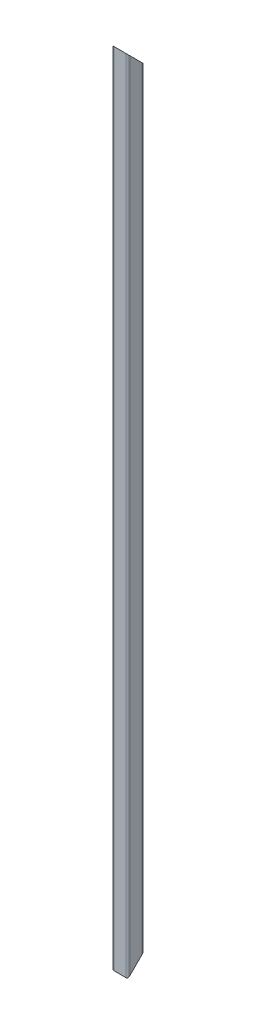
ISO-10303-21;
HEADER;
FILE_DESCRIPTION(('STEP AP214'),'2;1');
FILE_NAME('part.step','',(''),(''),'','','');
FILE_SCHEMA(('AUTOMOTIVE_DESIGN { 1 0 10303 214 1 1 1 1 }'));
ENDSEC;
DATA;
#1=APPLICATION_CONTEXT('core data for automotive mechanical design processes');
#2=APPLICATION_PROTOCOL_DEFINITION('international standard','automotive_design',2000,#1);
#3=PRODUCT_CONTEXT('',#1,'mechanical');
#4=PRODUCT('Part','Part','',(#3));
#5=PRODUCT_RELATED_PRODUCT_CATEGORY('part','',(#4));
#6=PRODUCT_DEFINITION_FORMATION('','',#4);
#7=PRODUCT_DEFINITION_CONTEXT('part definition',#1,'design');
#8=PRODUCT_DEFINITION('design','',#6,#7);
#9=PRODUCT_DEFINITION_SHAPE('','',#8);
#10=(LENGTH_UNIT() NAMED_UNIT(*) SI_UNIT(.MILLI.,.METRE.));
#11=(NAMED_UNIT(*) PLANE_ANGLE_UNIT() SI_UNIT($,.RADIAN.));
#12=(NAMED_UNIT(*) SI_UNIT($,.STERADIAN.) SOLID_ANGLE_UNIT());
#13=UNCERTAINTY_MEASURE_WITH_UNIT(LENGTH_MEASURE(1.E-05),#10,'distance_accuracy_value','');
#14=(GEOMETRIC_REPRESENTATION_CONTEXT(3) GLOBAL_UNCERTAINTY_ASSIGNED_CONTEXT((#13)) GLOBAL_UNIT_ASSIGNED_CONTEXT((#10,
#11,#12)) REPRESENTATION_CONTEXT('',''));
#15=CARTESIAN_POINT('',(0.,0.,0.));
#16=DIRECTION('',(0.,0.,1.));
#17=DIRECTION('',(1.,0.,0.));
#18=AXIS2_PLACEMENT_3D('',#15,#16,#17);
#19=CARTESIAN_POINT('',(-15.5,-2.22044604925031E-13,15.5000000000002));
#20=DIRECTION('',(0.,1.,0.));
#21=DIRECTION('',(0.,0.,1.));
#22=AXIS2_PLACEMENT_3D('',#19,#20,#21);
#23=CYLINDRICAL_SURFACE('',#22,4.5);
#24=CARTESIAN_POINT('',(-15.5,-15.5000000000002,15.5000000000002));
#25=DIRECTION('',(0.,-0.707106781186548,-0.707106781186548));
#26=DIRECTION('',(0.,0.707106781186548,-0.707106781186548));
#27=AXIS2_PLACEMENT_3D('',#24,#25,#26);
#28=ELLIPSE('',#27,6.36396103067893,4.5);
#29=CARTESIAN_POINT('',(-15.5,-20.0000000000002,20.0000000000002));
#30=VERTEX_POINT('',#29);
#31=CARTESIAN_POINT('',(-20.,-15.5000000000002,15.5000000000002));
#32=VERTEX_POINT('',#31);
#33=EDGE_CURVE('E255',#30,#32,#28,.T.);
#34=ORIENTED_EDGE('',*,*,#33,.F.);
#35=DIRECTION('',(0.,1.,0.));
#36=VECTOR('',#35,1.);
#37=CARTESIAN_POINT('',(-15.5,-2.22044604925031E-13,20.0000000000002));
#38=LINE('',#37,#36);
#39=CARTESIAN_POINT('',(-15.5,1980.,20.0000000000002));
#40=VERTEX_POINT('',#39);
#41=EDGE_CURVE('E53',#30,#40,#38,.T.);
#42=ORIENTED_EDGE('',*,*,#41,.T.);
#43=CARTESIAN_POINT('',(-15.5,1975.5,15.5000000000002));
#44=DIRECTION('',(0.,0.707106781186547,-0.707106781186548));
#45=DIRECTION('',(0.,0.707106781186548,0.707106781186547));
#46=AXIS2_PLACEMENT_3D('',#43,#44,#45);
#47=ELLIPSE('',#46,6.36396103067893,4.5);
#48=CARTESIAN_POINT('',(-20.,1975.5,15.5000000000003));
#49=VERTEX_POINT('',#48);
#50=EDGE_CURVE('E176',#49,#40,#47,.T.);
#51=ORIENTED_EDGE('',*,*,#50,.F.);
#52=DIRECTION('',(0.,1.,0.));
#53=VECTOR('',#52,1.);
#54=CARTESIAN_POINT('',(-20.,-2.22044604925031E-13,15.5000000000002));
#55=LINE('',#54,#53);
#56=EDGE_CURVE('E188',#32,#49,#55,.T.);
#57=ORIENTED_EDGE('',*,*,#56,.F.);
#58=EDGE_LOOP('',(#34,#42,#51,#57));
#59=FACE_BOUND('',#58,.T.);
#60=ADVANCED_FACE('F39',(#59),#23,.T.);
#61=CARTESIAN_POINT('',(-20.,-2.22044604925031E-13,15.5000000000002));
#62=DIRECTION('',(1.,0.,0.));
#63=DIRECTION('',(0.,0.,-1.));
#64=AXIS2_PLACEMENT_3D('',#61,#62,#63);
#65=PLANE('',#64);
#66=DIRECTION('',(0.,0.707106781186548,-0.707106781186548));
#67=VECTOR('',#66,1.);
#68=CARTESIAN_POINT('',(-20.,-7.75000000000022,7.75000000000022));
#69=LINE('',#68,#67);
#70=CARTESIAN_POINT('',(-20.,15.4999999999998,-15.4999999999998));
#71=VERTEX_POINT('',#70);
#72=EDGE_CURVE('E290',#32,#71,#69,.T.);
#73=ORIENTED_EDGE('',*,*,#72,.F.);
#74=ORIENTED_EDGE('',*,*,#56,.T.);
#75=DIRECTION('',(0.,0.707106781186548,0.707106781186547));
#76=VECTOR('',#75,1.);
#77=CARTESIAN_POINT('',(-20.,987.75,-972.25));
#78=LINE('',#77,#76);
#79=CARTESIAN_POINT('',(-20.,1944.5,-15.4999999999998));
#80=VERTEX_POINT('',#79);
#81=EDGE_CURVE('E250',#80,#49,#78,.T.);
#82=ORIENTED_EDGE('',*,*,#81,.F.);
#83=DIRECTION('',(0.,1.,0.));
#84=VECTOR('',#83,1.);
#85=CARTESIAN_POINT('',(-20.,-2.22044604925031E-13,-15.4999999999998));
#86=LINE('',#85,#84);
#87=EDGE_CURVE('E186',#71,#80,#86,.T.);
#88=ORIENTED_EDGE('',*,*,#87,.F.);
#89=EDGE_LOOP('',(#73,#74,#82,#88));
#90=FACE_BOUND('',#89,.T.);
#91=ADVANCED_FACE('F289',(#90),#65,.F.);
#92=CARTESIAN_POINT('',(-15.5,-2.22044604925031E-13,-15.4999999999998));
#93=DIRECTION('',(0.,1.,0.));
#94=DIRECTION('',(0.,0.,1.));
#95=AXIS2_PLACEMENT_3D('',#92,#93,#94);
#96=CYLINDRICAL_SURFACE('',#95,4.5);
#97=CARTESIAN_POINT('',(-15.5,15.4999999999998,-15.4999999999998));
#98=DIRECTION('',(0.,-0.707106781186548,-0.707106781186548));
#99=DIRECTION('',(0.,0.707106781186548,-0.707106781186548));
#100=AXIS2_PLACEMENT_3D('',#97,#98,#99);
#101=ELLIPSE('',#100,6.36396103067893,4.5);
#102=CARTESIAN_POINT('',(-15.5,19.9999999999998,-19.9999999999998));
#103=VERTEX_POINT('',#102);
#104=EDGE_CURVE('E287',#71,#103,#101,.T.);
#105=ORIENTED_EDGE('',*,*,#104,.F.);
#106=ORIENTED_EDGE('',*,*,#87,.T.);
#107=CARTESIAN_POINT('',(-15.5,1944.5,-15.4999999999998));
#108=DIRECTION('',(0.,0.707106781186547,-0.707106781186548));
#109=DIRECTION('',(0.,0.707106781186548,0.707106781186547));
#110=AXIS2_PLACEMENT_3D('',#107,#108,#109);
#111=ELLIPSE('',#110,6.36396103067893,4.5);
#112=CARTESIAN_POINT('',(-15.5,1940.,-19.9999999999998));
#113=VERTEX_POINT('',#112);
#114=EDGE_CURVE('E248',#113,#80,#111,.T.);
#115=ORIENTED_EDGE('',*,*,#114,.F.);
#116=DIRECTION('',(0.,1.,0.));
#117=VECTOR('',#116,1.);
#118=CARTESIAN_POINT('',(-15.5,-2.22044604925031E-13,-19.9999999999998));
#119=LINE('',#118,#117);
#120=EDGE_CURVE('E184',#103,#113,#119,.T.);
#121=ORIENTED_EDGE('',*,*,#120,.F.);
#122=EDGE_LOOP('',(#105,#106,#115,#121));
#123=FACE_BOUND('',#122,.T.);
#124=ADVANCED_FACE('F284',(#123),#96,.T.);
#125=CARTESIAN_POINT('',(-15.5,-2.22044604925031E-13,-19.9999999999998));
#126=DIRECTION('',(0.,0.,1.));
#127=DIRECTION('',(1.,0.,0.));
#128=AXIS2_PLACEMENT_3D('',#125,#126,#127);
#129=PLANE('',#128);
#130=DIRECTION('',(1.,0.,0.));
#131=VECTOR('',#130,1.);
#132=CARTESIAN_POINT('',(-15.5,19.9999999999998,-19.9999999999998));
#133=LINE('',#132,#131);
#134=CARTESIAN_POINT('',(15.5,19.9999999999998,-19.9999999999998));
#135=VERTEX_POINT('',#134);
#136=EDGE_CURVE('E471',#103,#135,#133,.T.);
#137=ORIENTED_EDGE('',*,*,#136,.F.);
#138=ORIENTED_EDGE('',*,*,#120,.T.);
#139=DIRECTION('',(-1.,0.,0.));
#140=VECTOR('',#139,1.);
#141=CARTESIAN_POINT('',(-15.5,1940.,-19.9999999999998));
#142=LINE('',#141,#140);
#143=CARTESIAN_POINT('',(15.5,1940.,-19.9999999999998));
#144=VERTEX_POINT('',#143);
#145=EDGE_CURVE('E245',#144,#113,#142,.T.);
#146=ORIENTED_EDGE('',*,*,#145,.F.);
#147=DIRECTION('',(0.,1.,0.));
#148=VECTOR('',#147,1.);
#149=CARTESIAN_POINT('',(15.5,-2.22044604925031E-13,-19.9999999999998));
#150=LINE('',#149,#148);
#151=EDGE_CURVE('E182',#135,#144,#150,.T.);
#152=ORIENTED_EDGE('',*,*,#151,.F.);
#153=EDGE_LOOP('',(#137,#138,#146,#152));
#154=FACE_BOUND('',#153,.T.);
#155=ADVANCED_FACE('F280',(#154),#129,.F.);
#156=CARTESIAN_POINT('',(15.5,-2.22044604925031E-13,-15.4999999999998));
#157=DIRECTION('',(0.,1.,0.));
#158=DIRECTION('',(0.,0.,1.));
#159=AXIS2_PLACEMENT_3D('',#156,#157,#158);
#160=CYLINDRICAL_SURFACE('',#159,4.5);
#161=CARTESIAN_POINT('',(15.5,15.4999999999998,-15.4999999999998));
#162=DIRECTION('',(0.,-0.707106781186548,-0.707106781186548));
#163=DIRECTION('',(0.,0.707106781186548,-0.707106781186548));
#164=AXIS2_PLACEMENT_3D('',#161,#162,#163);
#165=ELLIPSE('',#164,6.36396103067893,4.5);
#166=CARTESIAN_POINT('',(20.,15.4999999999998,-15.4999999999998));
#167=VERTEX_POINT('',#166);
#168=EDGE_CURVE('E277',#135,#167,#165,.T.);
#169=ORIENTED_EDGE('',*,*,#168,.F.);
#170=ORIENTED_EDGE('',*,*,#151,.T.);
#171=CARTESIAN_POINT('',(15.5,1944.5,-15.4999999999998));
#172=DIRECTION('',(0.,0.707106781186547,-0.707106781186548));
#173=DIRECTION('',(0.,0.707106781186548,0.707106781186547));
#174=AXIS2_PLACEMENT_3D('',#171,#172,#173);
#175=ELLIPSE('',#174,6.36396103067893,4.5);
#176=CARTESIAN_POINT('',(20.,1944.5,-15.4999999999998));
#177=VERTEX_POINT('',#176);
#178=EDGE_CURVE('E242',#177,#144,#175,.T.);
#179=ORIENTED_EDGE('',*,*,#178,.F.);
#180=DIRECTION('',(0.,1.,0.));
#181=VECTOR('',#180,1.);
#182=CARTESIAN_POINT('',(20.,-2.22044604925031E-13,-15.4999999999998));
#183=LINE('',#182,#181);
#184=EDGE_CURVE('E180',#167,#177,#183,.T.);
#185=ORIENTED_EDGE('',*,*,#184,.F.);
#186=EDGE_LOOP('',(#169,#170,#179,#185));
#187=FACE_BOUND('',#186,.T.);
#188=ADVANCED_FACE('F274',(#187),#160,.T.);
#189=CARTESIAN_POINT('',(20.,-2.22044604925031E-13,15.5000000000002));
#190=DIRECTION('',(-1.,0.,0.));
#191=DIRECTION('',(0.,0.,1.));
#192=AXIS2_PLACEMENT_3D('',#189,#190,#191);
#193=PLANE('',#192);
#194=DIRECTION('',(0.,-0.707106781186548,0.707106781186548));
#195=VECTOR('',#194,1.);
#196=CARTESIAN_POINT('',(20.,-7.75000000000022,7.75000000000022));
#197=LINE('',#196,#195);
#198=CARTESIAN_POINT('',(20.,-15.5000000000002,15.5000000000002));
#199=VERTEX_POINT('',#198);
#200=EDGE_CURVE('E271',#167,#199,#197,.T.);
#201=ORIENTED_EDGE('',*,*,#200,.F.);
#202=ORIENTED_EDGE('',*,*,#184,.T.);
#203=DIRECTION('',(0.,-0.707106781186548,-0.707106781186547));
#204=VECTOR('',#203,1.);
#205=CARTESIAN_POINT('',(20.,987.75,-972.25));
#206=LINE('',#205,#204);
#207=CARTESIAN_POINT('',(20.,1975.5,15.5000000000002));
#208=VERTEX_POINT('',#207);
#209=EDGE_CURVE('E239',#208,#177,#206,.T.);
#210=ORIENTED_EDGE('',*,*,#209,.F.);
#211=DIRECTION('',(0.,1.,0.));
#212=VECTOR('',#211,1.);
#213=CARTESIAN_POINT('',(20.,-2.22044604925031E-13,15.5000000000002));
#214=LINE('',#213,#212);
#215=EDGE_CURVE('E178',#199,#208,#214,.T.);
#216=ORIENTED_EDGE('',*,*,#215,.F.);
#217=EDGE_LOOP('',(#201,#202,#210,#216));
#218=FACE_BOUND('',#217,.T.);
#219=ADVANCED_FACE('F268',(#218),#193,.F.);
#220=CARTESIAN_POINT('',(15.5,-2.22044604925031E-13,15.5000000000002));
#221=DIRECTION('',(0.,1.,0.));
#222=DIRECTION('',(0.,0.,1.));
#223=AXIS2_PLACEMENT_3D('',#220,#221,#222);
#224=CYLINDRICAL_SURFACE('',#223,4.5);
#225=CARTESIAN_POINT('',(15.5,-15.5000000000002,15.5000000000002));
#226=DIRECTION('',(0.,-0.707106781186548,-0.707106781186548));
#227=DIRECTION('',(0.,0.707106781186548,-0.707106781186548));
#228=AXIS2_PLACEMENT_3D('',#225,#226,#227);
#229=ELLIPSE('',#228,6.36396103067893,4.5);
#230=CARTESIAN_POINT('',(15.5,-20.0000000000002,20.0000000000002));
#231=VERTEX_POINT('',#230);
#232=EDGE_CURVE('E452',#199,#231,#229,.T.);
#233=ORIENTED_EDGE('',*,*,#232,.F.);
#234=ORIENTED_EDGE('',*,*,#215,.T.);
#235=CARTESIAN_POINT('',(15.5,1975.5,15.5000000000002));
#236=DIRECTION('',(0.,0.707106781186547,-0.707106781186548));
#237=DIRECTION('',(0.,0.707106781186548,0.707106781186547));
#238=AXIS2_PLACEMENT_3D('',#235,#236,#237);
#239=ELLIPSE('',#238,6.36396103067893,4.5);
#240=CARTESIAN_POINT('',(15.5,1980.,20.0000000000002));
#241=VERTEX_POINT('',#240);
#242=EDGE_CURVE('E236',#241,#208,#239,.T.);
#243=ORIENTED_EDGE('',*,*,#242,.F.);
#244=DIRECTION('',(0.,1.,0.));
#245=VECTOR('',#244,1.);
#246=CARTESIAN_POINT('',(15.5,-2.22044604925031E-13,20.0000000000002));
#247=LINE('',#246,#245);
#248=EDGE_CURVE('E175',#231,#241,#247,.T.);
#249=ORIENTED_EDGE('',*,*,#248,.F.);
#250=EDGE_LOOP('',(#233,#234,#243,#249));
#251=FACE_BOUND('',#250,.T.);
#252=ADVANCED_FACE('F263',(#251),#224,.T.);
#253=CARTESIAN_POINT('',(-15.5,-2.22044604925031E-13,20.0000000000002));
#254=DIRECTION('',(0.,0.,-1.));
#255=DIRECTION('',(-1.,0.,0.));
#256=AXIS2_PLACEMENT_3D('',#253,#254,#255);
#257=PLANE('',#256);
#258=DIRECTION('',(-1.,0.,0.));
#259=VECTOR('',#258,1.);
#260=CARTESIAN_POINT('',(-15.5,-20.0000000000002,20.0000000000002));
#261=LINE('',#260,#259);
#262=EDGE_CURVE('E260',#231,#30,#261,.T.);
#263=ORIENTED_EDGE('',*,*,#262,.F.);
#264=ORIENTED_EDGE('',*,*,#248,.T.);
#265=DIRECTION('',(1.,0.,0.));
#266=VECTOR('',#265,1.);
#267=CARTESIAN_POINT('',(-15.5,1980.,20.0000000000002));
#268=LINE('',#267,#266);
#269=EDGE_CURVE('E233',#40,#241,#268,.T.);
#270=ORIENTED_EDGE('',*,*,#269,.F.);
#271=ORIENTED_EDGE('',*,*,#41,.F.);
#272=EDGE_LOOP('',(#263,#264,#270,#271));
#273=FACE_BOUND('',#272,.T.);
#274=ADVANCED_FACE('F257',(#273),#257,.F.);
#275=CARTESIAN_POINT('',(0.,1960.,0.));
#276=DIRECTION('',(0.,0.707106781186547,-0.707106781186548));
#277=DIRECTION('',(0.,0.707106781186548,0.707106781186547));
#278=AXIS2_PLACEMENT_3D('',#275,#276,#277);
#279=PLANE('',#278);
#280=CARTESIAN_POINT('',(-15.,1975.,15.0000000000002));
#281=DIRECTION('',(0.,0.707106781186547,-0.707106781186548));
#282=DIRECTION('',(0.,0.707106781186548,0.707106781186547));
#283=AXIS2_PLACEMENT_3D('',#280,#281,#282);
#284=ELLIPSE('',#283,4.24264068711928,3.);
#285=CARTESIAN_POINT('',(-18.,1975.,15.0000000000002));
#286=VERTEX_POINT('',#285);
#287=CARTESIAN_POINT('',(-15.,1978.,18.0000000000002));
#288=VERTEX_POINT('',#287);
#289=EDGE_CURVE('E167',#286,#288,#284,.T.);
#290=ORIENTED_EDGE('',*,*,#289,.F.);
#291=DIRECTION('',(0.,0.707106781186548,0.707106781186547));
#292=VECTOR('',#291,1.);
#293=CARTESIAN_POINT('',(-18.,987.5,-972.5));
#294=LINE('',#293,#292);
#295=CARTESIAN_POINT('',(-18.,1945.,-14.9999999999997));
#296=VERTEX_POINT('',#295);
#297=EDGE_CURVE('E46',#296,#286,#294,.T.);
#298=ORIENTED_EDGE('',*,*,#297,.F.);
#299=CARTESIAN_POINT('',(-15.,1945.,-14.9999999999998));
#300=DIRECTION('',(0.,0.707106781186547,-0.707106781186548));
#301=DIRECTION('',(0.,0.707106781186548,0.707106781186547));
#302=AXIS2_PLACEMENT_3D('',#299,#300,#301);
#303=ELLIPSE('',#302,4.24264068711928,3.);
#304=CARTESIAN_POINT('',(-15.,1942.,-17.9999999999998));
#305=VERTEX_POINT('',#304);
#306=EDGE_CURVE('E445',#305,#296,#303,.T.);
#307=ORIENTED_EDGE('',*,*,#306,.F.);
#308=DIRECTION('',(-1.,0.,0.));
#309=VECTOR('',#308,1.);
#310=CARTESIAN_POINT('',(-15.,1942.,-17.9999999999998));
#311=LINE('',#310,#309);
#312=CARTESIAN_POINT('',(15.,1942.,-17.9999999999998));
#313=VERTEX_POINT('',#312);
#314=EDGE_CURVE('E449',#313,#305,#311,.T.);
#315=ORIENTED_EDGE('',*,*,#314,.F.);
#316=CARTESIAN_POINT('',(15.,1945.,-14.9999999999998));
#317=DIRECTION('',(0.,0.707106781186547,-0.707106781186548));
#318=DIRECTION('',(0.,0.707106781186548,0.707106781186547));
#319=AXIS2_PLACEMENT_3D('',#316,#317,#318);
#320=ELLIPSE('',#319,4.24264068711928,3.);
#321=CARTESIAN_POINT('',(18.,1945.,-14.9999999999998));
#322=VERTEX_POINT('',#321);
#323=EDGE_CURVE('E224',#322,#313,#320,.T.);
#324=ORIENTED_EDGE('',*,*,#323,.F.);
#325=DIRECTION('',(0.,-0.707106781186548,-0.707106781186547));
#326=VECTOR('',#325,1.);
#327=CARTESIAN_POINT('',(18.,987.5,-972.5));
#328=LINE('',#327,#326);
#329=CARTESIAN_POINT('',(18.,1975.,15.0000000000002));
#330=VERTEX_POINT('',#329);
#331=EDGE_CURVE('E212',#330,#322,#328,.T.);
#332=ORIENTED_EDGE('',*,*,#331,.F.);
#333=CARTESIAN_POINT('',(15.,1975.,15.0000000000002));
#334=DIRECTION('',(0.,0.707106781186547,-0.707106781186548));
#335=DIRECTION('',(0.,0.707106781186548,0.707106781186547));
#336=AXIS2_PLACEMENT_3D('',#333,#334,#335);
#337=ELLIPSE('',#336,4.24264068711928,3.);
#338=CARTESIAN_POINT('',(15.,1978.,18.0000000000002));
#339=VERTEX_POINT('',#338);
#340=EDGE_CURVE('E221',#339,#330,#337,.T.);
#341=ORIENTED_EDGE('',*,*,#340,.F.);
#342=DIRECTION('',(1.,0.,0.));
#343=VECTOR('',#342,1.);
#344=CARTESIAN_POINT('',(-15.,1978.,18.0000000000002));
#345=LINE('',#344,#343);
#346=EDGE_CURVE('E227',#288,#339,#345,.T.);
#347=ORIENTED_EDGE('',*,*,#346,.F.);
#348=EDGE_LOOP('',(#290,#298,#307,#315,#324,#332,#341,#347));
#349=FACE_BOUND('',#348,.T.);
#350=ORIENTED_EDGE('',*,*,#81,.T.);
#351=ORIENTED_EDGE('',*,*,#50,.T.);
#352=ORIENTED_EDGE('',*,*,#269,.T.);
#353=ORIENTED_EDGE('',*,*,#242,.T.);
#354=ORIENTED_EDGE('',*,*,#209,.T.);
#355=ORIENTED_EDGE('',*,*,#178,.T.);
#356=ORIENTED_EDGE('',*,*,#145,.T.);
#357=ORIENTED_EDGE('',*,*,#114,.T.);
#358=EDGE_LOOP('',(#350,#351,#352,#353,#354,#355,#356,#357));
#359=FACE_BOUND('',#358,.T.);
#360=ADVANCED_FACE('F219',(#349,#359),#279,.T.);
#361=CARTESIAN_POINT('',(-15.,-2.22044604925031E-13,15.0000000000002));
#362=DIRECTION('',(0.,1.,0.));
#363=DIRECTION('',(0.,0.,1.));
#364=AXIS2_PLACEMENT_3D('',#361,#362,#363);
#365=CYLINDRICAL_SURFACE('',#364,3.);
#366=DIRECTION('',(0.,1.,0.));
#367=VECTOR('',#366,1.);
#368=CARTESIAN_POINT('',(-15.,-2.22044604925031E-13,18.0000000000002));
#369=LINE('',#368,#367);
#370=CARTESIAN_POINT('',(-15.,-18.0000000000002,18.0000000000002));
#371=VERTEX_POINT('',#370);
#372=EDGE_CURVE('E158',#371,#288,#369,.T.);
#373=ORIENTED_EDGE('',*,*,#372,.F.);
#374=CARTESIAN_POINT('',(-15.,-15.0000000000002,15.0000000000002));
#375=DIRECTION('',(0.,-0.707106781186548,-0.707106781186548));
#376=DIRECTION('',(0.,0.707106781186548,-0.707106781186548));
#377=AXIS2_PLACEMENT_3D('',#374,#375,#376);
#378=ELLIPSE('',#377,4.24264068711928,3.);
#379=CARTESIAN_POINT('',(-18.,-15.0000000000002,15.0000000000002));
#380=VERTEX_POINT('',#379);
#381=EDGE_CURVE('E11',#371,#380,#378,.T.);
#382=ORIENTED_EDGE('',*,*,#381,.T.);
#383=DIRECTION('',(0.,1.,0.));
#384=VECTOR('',#383,1.);
#385=CARTESIAN_POINT('',(-18.,-2.22044604925031E-13,15.0000000000002));
#386=LINE('',#385,#384);
#387=EDGE_CURVE('E189',#380,#286,#386,.T.);
#388=ORIENTED_EDGE('',*,*,#387,.T.);
#389=ORIENTED_EDGE('',*,*,#289,.T.);
#390=EDGE_LOOP('',(#373,#382,#388,#389));
#391=FACE_BOUND('',#390,.T.);
#392=ADVANCED_FACE('F165',(#391),#365,.F.);
#393=CARTESIAN_POINT('',(-15.,-2.22044604925031E-13,18.0000000000002));
#394=DIRECTION('',(0.,0.,-1.));
#395=DIRECTION('',(-1.,0.,0.));
#396=AXIS2_PLACEMENT_3D('',#393,#394,#395);
#397=PLANE('',#396);
#398=DIRECTION('',(0.,1.,0.));
#399=VECTOR('',#398,1.);
#400=CARTESIAN_POINT('',(15.,-2.22044604925031E-13,18.0000000000002));
#401=LINE('',#400,#399);
#402=CARTESIAN_POINT('',(15.,-18.0000000000002,18.0000000000002));
#403=VERTEX_POINT('',#402);
#404=EDGE_CURVE('E160',#403,#339,#401,.T.);
#405=ORIENTED_EDGE('',*,*,#404,.F.);
#406=DIRECTION('',(-1.,0.,0.));
#407=VECTOR('',#406,1.);
#408=CARTESIAN_POINT('',(-15.,-18.0000000000002,18.0000000000002));
#409=LINE('',#408,#407);
#410=EDGE_CURVE('E151',#403,#371,#409,.T.);
#411=ORIENTED_EDGE('',*,*,#410,.T.);
#412=ORIENTED_EDGE('',*,*,#372,.T.);
#413=ORIENTED_EDGE('',*,*,#346,.T.);
#414=EDGE_LOOP('',(#405,#411,#412,#413));
#415=FACE_BOUND('',#414,.T.);
#416=ADVANCED_FACE('F156',(#415),#397,.T.);
#417=CARTESIAN_POINT('',(15.,-2.22044604925031E-13,15.0000000000002));
#418=DIRECTION('',(0.,1.,0.));
#419=DIRECTION('',(0.,0.,1.));
#420=AXIS2_PLACEMENT_3D('',#417,#418,#419);
#421=CYLINDRICAL_SURFACE('',#420,3.);
#422=DIRECTION('',(0.,1.,0.));
#423=VECTOR('',#422,1.);
#424=CARTESIAN_POINT('',(18.,-2.22044604925031E-13,15.0000000000002));
#425=LINE('',#424,#423);
#426=CARTESIAN_POINT('',(18.,-15.0000000000002,15.0000000000002));
#427=VERTEX_POINT('',#426);
#428=EDGE_CURVE('E170',#427,#330,#425,.T.);
#429=ORIENTED_EDGE('',*,*,#428,.F.);
#430=CARTESIAN_POINT('',(15.,-15.0000000000002,15.0000000000002));
#431=DIRECTION('',(0.,-0.707106781186548,-0.707106781186548));
#432=DIRECTION('',(0.,0.707106781186548,-0.707106781186548));
#433=AXIS2_PLACEMENT_3D('',#430,#431,#432);
#434=ELLIPSE('',#433,4.24264068711928,3.);
#435=EDGE_CURVE('E162',#427,#403,#434,.T.);
#436=ORIENTED_EDGE('',*,*,#435,.T.);
#437=ORIENTED_EDGE('',*,*,#404,.T.);
#438=ORIENTED_EDGE('',*,*,#340,.T.);
#439=EDGE_LOOP('',(#429,#436,#437,#438));
#440=FACE_BOUND('',#439,.T.);
#441=ADVANCED_FACE('F226',(#440),#421,.F.);
#442=CARTESIAN_POINT('',(18.,-2.22044604925031E-13,15.0000000000002));
#443=DIRECTION('',(-1.,0.,0.));
#444=DIRECTION('',(0.,0.,1.));
#445=AXIS2_PLACEMENT_3D('',#442,#443,#444);
#446=PLANE('',#445);
#447=DIRECTION('',(0.,1.,0.));
#448=VECTOR('',#447,1.);
#449=CARTESIAN_POINT('',(18.,-2.22044604925031E-13,-14.9999999999998));
#450=LINE('',#449,#448);
#451=CARTESIAN_POINT('',(18.,14.9999999999998,-14.9999999999998));
#452=VERTEX_POINT('',#451);
#453=EDGE_CURVE('E204',#452,#322,#450,.T.);
#454=ORIENTED_EDGE('',*,*,#453,.F.);
#455=DIRECTION('',(0.,-0.707106781186548,0.707106781186548));
#456=VECTOR('',#455,1.);
#457=CARTESIAN_POINT('',(18.,-7.50000000000022,7.50000000000022));
#458=LINE('',#457,#456);
#459=EDGE_CURVE('E213',#452,#427,#458,.T.);
#460=ORIENTED_EDGE('',*,*,#459,.T.);
#461=ORIENTED_EDGE('',*,*,#428,.T.);
#462=ORIENTED_EDGE('',*,*,#331,.T.);
#463=EDGE_LOOP('',(#454,#460,#461,#462));
#464=FACE_BOUND('',#463,.T.);
#465=ADVANCED_FACE('F211',(#464),#446,.T.);
#466=CARTESIAN_POINT('',(15.,-2.22044604925031E-13,-14.9999999999998));
#467=DIRECTION('',(0.,1.,0.));
#468=DIRECTION('',(0.,0.,1.));
#469=AXIS2_PLACEMENT_3D('',#466,#467,#468);
#470=CYLINDRICAL_SURFACE('',#469,3.);
#471=DIRECTION('',(0.,1.,0.));
#472=VECTOR('',#471,1.);
#473=CARTESIAN_POINT('',(15.,-2.22044604925031E-13,-17.9999999999998));
#474=LINE('',#473,#472);
#475=CARTESIAN_POINT('',(15.,17.9999999999998,-17.9999999999998));
#476=VERTEX_POINT('',#475);
#477=EDGE_CURVE('E202',#476,#313,#474,.T.);
#478=ORIENTED_EDGE('',*,*,#477,.F.);
#479=CARTESIAN_POINT('',(15.,14.9999999999998,-14.9999999999998));
#480=DIRECTION('',(0.,-0.707106781186548,-0.707106781186548));
#481=DIRECTION('',(0.,0.707106781186548,-0.707106781186548));
#482=AXIS2_PLACEMENT_3D('',#479,#480,#481);
#483=ELLIPSE('',#482,4.24264068711928,3.);
#484=EDGE_CURVE('E458',#476,#452,#483,.T.);
#485=ORIENTED_EDGE('',*,*,#484,.T.);
#486=ORIENTED_EDGE('',*,*,#453,.T.);
#487=ORIENTED_EDGE('',*,*,#323,.T.);
#488=EDGE_LOOP('',(#478,#485,#486,#487));
#489=FACE_BOUND('',#488,.T.);
#490=ADVANCED_FACE('F317',(#489),#470,.F.);
#491=CARTESIAN_POINT('',(-15.,-2.22044604925031E-13,-17.9999999999998));
#492=DIRECTION('',(0.,0.,1.));
#493=DIRECTION('',(1.,0.,0.));
#494=AXIS2_PLACEMENT_3D('',#491,#492,#493);
#495=PLANE('',#494);
#496=DIRECTION('',(0.,1.,0.));
#497=VECTOR('',#496,1.);
#498=CARTESIAN_POINT('',(-15.,-2.22044604925031E-13,-17.9999999999998));
#499=LINE('',#498,#497);
#500=CARTESIAN_POINT('',(-15.,17.9999999999998,-17.9999999999998));
#501=VERTEX_POINT('',#500);
#502=EDGE_CURVE('E196',#501,#305,#499,.T.);
#503=ORIENTED_EDGE('',*,*,#502,.F.);
#504=DIRECTION('',(1.,0.,0.));
#505=VECTOR('',#504,1.);
#506=CARTESIAN_POINT('',(-15.,17.9999999999998,-17.9999999999998));
#507=LINE('',#506,#505);
#508=EDGE_CURVE('E459',#501,#476,#507,.T.);
#509=ORIENTED_EDGE('',*,*,#508,.T.);
#510=ORIENTED_EDGE('',*,*,#477,.T.);
#511=ORIENTED_EDGE('',*,*,#314,.T.);
#512=EDGE_LOOP('',(#503,#509,#510,#511));
#513=FACE_BOUND('',#512,.T.);
#514=ADVANCED_FACE('F320',(#513),#495,.T.);
#515=CARTESIAN_POINT('',(-15.,-2.22044604925031E-13,-14.9999999999998));
#516=DIRECTION('',(0.,1.,0.));
#517=DIRECTION('',(0.,0.,1.));
#518=AXIS2_PLACEMENT_3D('',#515,#516,#517);
#519=CYLINDRICAL_SURFACE('',#518,3.);
#520=DIRECTION('',(0.,1.,0.));
#521=VECTOR('',#520,1.);
#522=CARTESIAN_POINT('',(-18.,-2.22044604925031E-13,-14.9999999999998));
#523=LINE('',#522,#521);
#524=CARTESIAN_POINT('',(-18.,14.9999999999998,-14.9999999999998));
#525=VERTEX_POINT('',#524);
#526=EDGE_CURVE('E194',#525,#296,#523,.T.);
#527=ORIENTED_EDGE('',*,*,#526,.F.);
#528=CARTESIAN_POINT('',(-15.,14.9999999999998,-14.9999999999998));
#529=DIRECTION('',(0.,-0.707106781186548,-0.707106781186548));
#530=DIRECTION('',(0.,0.707106781186548,-0.707106781186548));
#531=AXIS2_PLACEMENT_3D('',#528,#529,#530);
#532=ELLIPSE('',#531,4.24264068711928,3.);
#533=EDGE_CURVE('E461',#525,#501,#532,.T.);
#534=ORIENTED_EDGE('',*,*,#533,.T.);
#535=ORIENTED_EDGE('',*,*,#502,.T.);
#536=ORIENTED_EDGE('',*,*,#306,.T.);
#537=EDGE_LOOP('',(#527,#534,#535,#536));
#538=FACE_BOUND('',#537,.T.);
#539=ADVANCED_FACE('F324',(#538),#519,.F.);
#540=CARTESIAN_POINT('',(-18.,-2.22044604925031E-13,15.0000000000002));
#541=DIRECTION('',(1.,0.,0.));
#542=DIRECTION('',(0.,0.,-1.));
#543=AXIS2_PLACEMENT_3D('',#540,#541,#542);
#544=PLANE('',#543);
#545=ORIENTED_EDGE('',*,*,#387,.F.);
#546=DIRECTION('',(0.,0.707106781186548,-0.707106781186548));
#547=VECTOR('',#546,1.);
#548=CARTESIAN_POINT('',(-18.,-7.50000000000022,7.50000000000022));
#549=LINE('',#548,#547);
#550=EDGE_CURVE('E61',#380,#525,#549,.T.);
#551=ORIENTED_EDGE('',*,*,#550,.T.);
#552=ORIENTED_EDGE('',*,*,#526,.T.);
#553=ORIENTED_EDGE('',*,*,#297,.T.);
#554=EDGE_LOOP('',(#545,#551,#552,#553));
#555=FACE_BOUND('',#554,.T.);
#556=ADVANCED_FACE('F328',(#555),#544,.T.);
#557=CARTESIAN_POINT('',(0.,0.,0.));
#558=DIRECTION('',(0.,-0.707106781186548,-0.707106781186548));
#559=DIRECTION('',(0.,0.707106781186548,-0.707106781186548));
#560=AXIS2_PLACEMENT_3D('',#557,#558,#559);
#561=PLANE('',#560);
#562=ORIENTED_EDGE('',*,*,#550,.F.);
#563=ORIENTED_EDGE('',*,*,#381,.F.);
#564=ORIENTED_EDGE('',*,*,#410,.F.);
#565=ORIENTED_EDGE('',*,*,#435,.F.);
#566=ORIENTED_EDGE('',*,*,#459,.F.);
#567=ORIENTED_EDGE('',*,*,#484,.F.);
#568=ORIENTED_EDGE('',*,*,#508,.F.);
#569=ORIENTED_EDGE('',*,*,#533,.F.);
#570=EDGE_LOOP('',(#562,#563,#564,#565,#566,#567,#568,#569));
#571=FACE_BOUND('',#570,.T.);
#572=ORIENTED_EDGE('',*,*,#232,.T.);
#573=ORIENTED_EDGE('',*,*,#262,.T.);
#574=ORIENTED_EDGE('',*,*,#33,.T.);
#575=ORIENTED_EDGE('',*,*,#72,.T.);
#576=ORIENTED_EDGE('',*,*,#104,.T.);
#577=ORIENTED_EDGE('',*,*,#136,.T.);
#578=ORIENTED_EDGE('',*,*,#168,.T.);
#579=ORIENTED_EDGE('',*,*,#200,.T.);
#580=EDGE_LOOP('',(#572,#573,#574,#575,#576,#577,#578,#579));
#581=FACE_BOUND('',#580,.T.);
#582=ADVANCED_FACE('F149',(#571,#581),#561,.T.);
#583=CLOSED_SHELL('',(#60,#91,#124,#155,#188,#219,#252,#274,#360,#392,#416,#441,#465,#490,#514,
#539,#556,#582));
#584=MANIFOLD_SOLID_BREP('B2',#583);
#585=ADVANCED_BREP_SHAPE_REPRESENTATION('',(#18,#584),#14);
#586=SHAPE_DEFINITION_REPRESENTATION(#9,#585);
ENDSEC;
END-ISO-10303-21;
